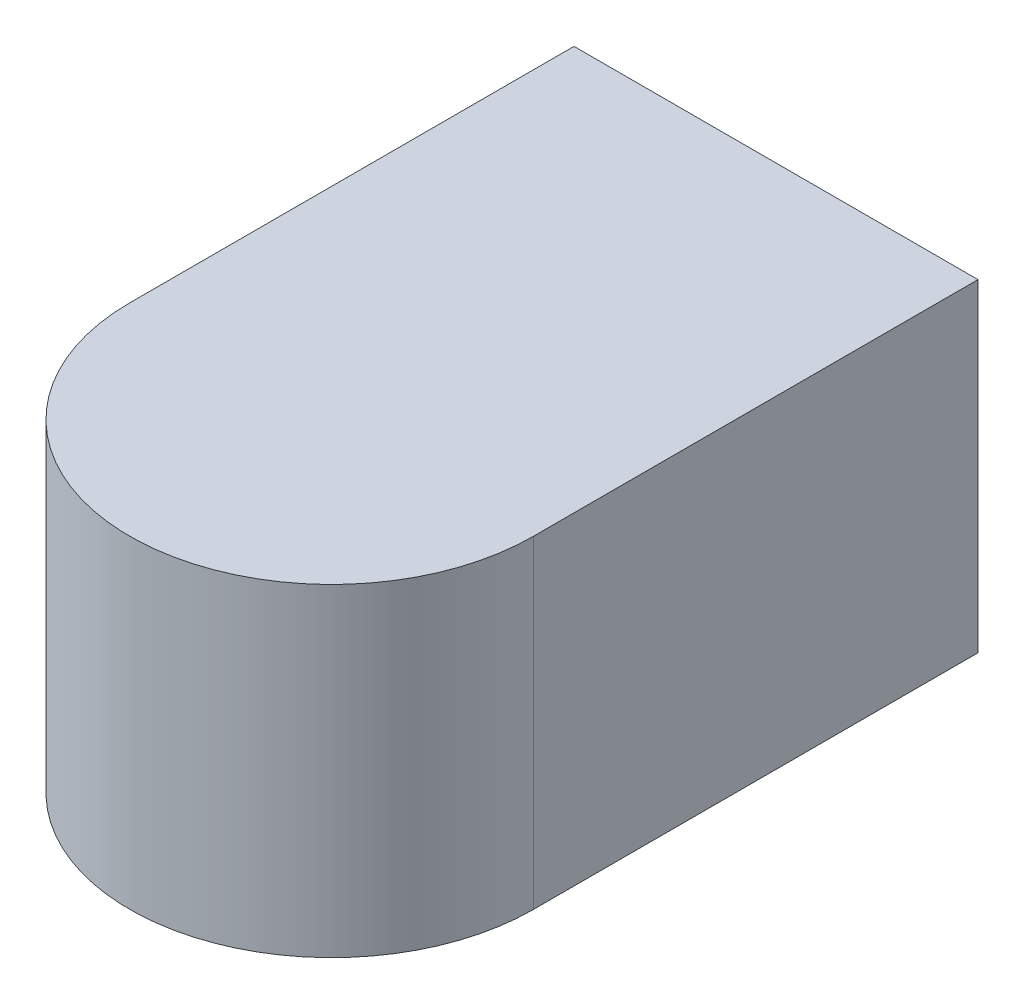
ISO-10303-21;
HEADER;
FILE_DESCRIPTION(('STEP AP214'),'2;1');
FILE_NAME('part.step','',(''),(''),'','','');
FILE_SCHEMA(('AUTOMOTIVE_DESIGN { 1 0 10303 214 1 1 1 1 }'));
ENDSEC;
DATA;
#1=APPLICATION_CONTEXT('core data for automotive mechanical design processes');
#2=APPLICATION_PROTOCOL_DEFINITION('international standard','automotive_design',2000,#1);
#3=PRODUCT_CONTEXT('',#1,'mechanical');
#4=PRODUCT('Part','Part','',(#3));
#5=PRODUCT_RELATED_PRODUCT_CATEGORY('part','',(#4));
#6=PRODUCT_DEFINITION_FORMATION('','',#4);
#7=PRODUCT_DEFINITION_CONTEXT('part definition',#1,'design');
#8=PRODUCT_DEFINITION('design','',#6,#7);
#9=PRODUCT_DEFINITION_SHAPE('','',#8);
#10=(LENGTH_UNIT() NAMED_UNIT(*) SI_UNIT(.MILLI.,.METRE.));
#11=(NAMED_UNIT(*) PLANE_ANGLE_UNIT() SI_UNIT($,.RADIAN.));
#12=(NAMED_UNIT(*) SI_UNIT($,.STERADIAN.) SOLID_ANGLE_UNIT());
#13=UNCERTAINTY_MEASURE_WITH_UNIT(LENGTH_MEASURE(1.E-05),#10,'distance_accuracy_value','');
#14=(GEOMETRIC_REPRESENTATION_CONTEXT(3) GLOBAL_UNCERTAINTY_ASSIGNED_CONTEXT((#13)) GLOBAL_UNIT_ASSIGNED_CONTEXT((#10,
#11,#12)) REPRESENTATION_CONTEXT('',''));
#15=CARTESIAN_POINT('',(0.,0.,0.));
#16=DIRECTION('',(0.,0.,1.));
#17=DIRECTION('',(1.,0.,0.));
#18=AXIS2_PLACEMENT_3D('',#15,#16,#17);
#19=CARTESIAN_POINT('',(0.,0.,0.));
#20=DIRECTION('',(0.,1.,0.));
#21=DIRECTION('',(1.,0.,0.));
#22=AXIS2_PLACEMENT_3D('',#19,#20,#21);
#23=PLANE('',#22);
#24=DIRECTION('',(-1.,0.,0.));
#25=VECTOR('',#24,1.);
#26=CARTESIAN_POINT('',(0.875,0.,-1.5));
#27=LINE('',#26,#25);
#28=CARTESIAN_POINT('',(0.875,0.,-1.5));
#29=VERTEX_POINT('',#28);
#30=CARTESIAN_POINT('',(0.625,0.,-1.5));
#31=VERTEX_POINT('',#30);
#32=EDGE_CURVE('E11',#29,#31,#27,.T.);
#33=ORIENTED_EDGE('',*,*,#32,.F.);
#34=DIRECTION('',(0.,0.,-1.));
#35=VECTOR('',#34,1.);
#36=CARTESIAN_POINT('',(0.875,0.,-1.225));
#37=LINE('',#36,#35);
#38=CARTESIAN_POINT('',(0.875,0.,-1.225));
#39=VERTEX_POINT('',#38);
#40=EDGE_CURVE('E24',#39,#29,#37,.T.);
#41=ORIENTED_EDGE('',*,*,#40,.F.);
#42=CARTESIAN_POINT('',(0.75,0.,-1.225));
#43=DIRECTION('',(0.,1.,0.));
#44=DIRECTION('',(-1.,0.,0.));
#45=AXIS2_PLACEMENT_3D('',#42,#43,#44);
#46=CIRCLE('',#45,0.125);
#47=CARTESIAN_POINT('',(0.625,0.,-1.225));
#48=VERTEX_POINT('',#47);
#49=EDGE_CURVE('E61',#48,#39,#46,.T.);
#50=ORIENTED_EDGE('',*,*,#49,.F.);
#51=DIRECTION('',(0.,0.,1.));
#52=VECTOR('',#51,1.);
#53=CARTESIAN_POINT('',(0.625,0.,-1.5));
#54=LINE('',#53,#52);
#55=EDGE_CURVE('E37',#31,#48,#54,.T.);
#56=ORIENTED_EDGE('',*,*,#55,.F.);
#57=EDGE_LOOP('',(#33,#41,#50,#56));
#58=FACE_BOUND('',#57,.T.);
#59=ADVANCED_FACE('F17',(#58),#23,.F.);
#60=CARTESIAN_POINT('',(0.625,0.,-1.5));
#61=DIRECTION('',(-1.,0.,0.));
#62=DIRECTION('',(0.,0.,1.));
#63=AXIS2_PLACEMENT_3D('',#60,#61,#62);
#64=PLANE('',#63);
#65=DIRECTION('',(0.,1.,0.));
#66=VECTOR('',#65,1.);
#67=CARTESIAN_POINT('',(0.625,0.,-1.225));
#68=LINE('',#67,#66);
#69=CARTESIAN_POINT('',(0.625,0.2,-1.225));
#70=VERTEX_POINT('',#69);
#71=EDGE_CURVE('E84',#48,#70,#68,.T.);
#72=ORIENTED_EDGE('',*,*,#71,.T.);
#73=DIRECTION('',(0.,0.,1.));
#74=VECTOR('',#73,1.);
#75=CARTESIAN_POINT('',(0.625,0.2,-1.5));
#76=LINE('',#75,#74);
#77=CARTESIAN_POINT('',(0.625,0.2,-1.5));
#78=VERTEX_POINT('',#77);
#79=EDGE_CURVE('E74',#78,#70,#76,.T.);
#80=ORIENTED_EDGE('',*,*,#79,.F.);
#81=DIRECTION('',(0.,1.,0.));
#82=VECTOR('',#81,1.);
#83=CARTESIAN_POINT('',(0.625,0.,-1.5));
#84=LINE('',#83,#82);
#85=EDGE_CURVE('E81',#31,#78,#84,.T.);
#86=ORIENTED_EDGE('',*,*,#85,.F.);
#87=ORIENTED_EDGE('',*,*,#55,.T.);
#88=EDGE_LOOP('',(#72,#80,#86,#87));
#89=FACE_BOUND('',#88,.T.);
#90=ADVANCED_FACE('F89',(#89),#64,.T.);
#91=CARTESIAN_POINT('',(0.875,0.,-1.5));
#92=DIRECTION('',(0.,0.,-1.));
#93=DIRECTION('',(-1.,0.,0.));
#94=AXIS2_PLACEMENT_3D('',#91,#92,#93);
#95=PLANE('',#94);
#96=ORIENTED_EDGE('',*,*,#85,.T.);
#97=DIRECTION('',(-1.,0.,0.));
#98=VECTOR('',#97,1.);
#99=CARTESIAN_POINT('',(0.875,0.2,-1.5));
#100=LINE('',#99,#98);
#101=CARTESIAN_POINT('',(0.875,0.2,-1.5));
#102=VERTEX_POINT('',#101);
#103=EDGE_CURVE('E79',#102,#78,#100,.T.);
#104=ORIENTED_EDGE('',*,*,#103,.F.);
#105=DIRECTION('',(0.,1.,0.));
#106=VECTOR('',#105,1.);
#107=CARTESIAN_POINT('',(0.875,0.,-1.5));
#108=LINE('',#107,#106);
#109=EDGE_CURVE('E67',#29,#102,#108,.T.);
#110=ORIENTED_EDGE('',*,*,#109,.F.);
#111=ORIENTED_EDGE('',*,*,#32,.T.);
#112=EDGE_LOOP('',(#96,#104,#110,#111));
#113=FACE_BOUND('',#112,.T.);
#114=ADVANCED_FACE('F91',(#113),#95,.T.);
#115=CARTESIAN_POINT('',(0.875,0.,-1.225));
#116=DIRECTION('',(1.,0.,0.));
#117=DIRECTION('',(0.,0.,-1.));
#118=AXIS2_PLACEMENT_3D('',#115,#116,#117);
#119=PLANE('',#118);
#120=ORIENTED_EDGE('',*,*,#109,.T.);
#121=DIRECTION('',(0.,0.,-1.));
#122=VECTOR('',#121,1.);
#123=CARTESIAN_POINT('',(0.875,0.2,-1.225));
#124=LINE('',#123,#122);
#125=CARTESIAN_POINT('',(0.875,0.2,-1.225));
#126=VERTEX_POINT('',#125);
#127=EDGE_CURVE('E62',#126,#102,#124,.T.);
#128=ORIENTED_EDGE('',*,*,#127,.F.);
#129=DIRECTION('',(0.,1.,0.));
#130=VECTOR('',#129,1.);
#131=CARTESIAN_POINT('',(0.875,0.,-1.225));
#132=LINE('',#131,#130);
#133=EDGE_CURVE('E55',#39,#126,#132,.T.);
#134=ORIENTED_EDGE('',*,*,#133,.F.);
#135=ORIENTED_EDGE('',*,*,#40,.T.);
#136=EDGE_LOOP('',(#120,#128,#134,#135));
#137=FACE_BOUND('',#136,.T.);
#138=ADVANCED_FACE('F65',(#137),#119,.T.);
#139=CARTESIAN_POINT('',(0.75,0.,-1.225));
#140=DIRECTION('',(0.,1.,0.));
#141=DIRECTION('',(1.,0.,0.));
#142=AXIS2_PLACEMENT_3D('',#139,#140,#141);
#143=CYLINDRICAL_SURFACE('',#142,0.125);
#144=ORIENTED_EDGE('',*,*,#133,.T.);
#145=CARTESIAN_POINT('',(0.75,0.2,-1.225));
#146=DIRECTION('',(0.,1.,0.));
#147=DIRECTION('',(-1.,0.,0.));
#148=AXIS2_PLACEMENT_3D('',#145,#146,#147);
#149=CIRCLE('',#148,0.125);
#150=EDGE_CURVE('E60',#70,#126,#149,.T.);
#151=ORIENTED_EDGE('',*,*,#150,.F.);
#152=ORIENTED_EDGE('',*,*,#71,.F.);
#153=ORIENTED_EDGE('',*,*,#49,.T.);
#154=EDGE_LOOP('',(#144,#151,#152,#153));
#155=FACE_BOUND('',#154,.T.);
#156=ADVANCED_FACE('F57',(#155),#143,.T.);
#157=CARTESIAN_POINT('',(0.,0.2,0.));
#158=DIRECTION('',(0.,1.,0.));
#159=DIRECTION('',(1.,0.,0.));
#160=AXIS2_PLACEMENT_3D('',#157,#158,#159);
#161=PLANE('',#160);
#162=ORIENTED_EDGE('',*,*,#150,.T.);
#163=ORIENTED_EDGE('',*,*,#127,.T.);
#164=ORIENTED_EDGE('',*,*,#103,.T.);
#165=ORIENTED_EDGE('',*,*,#79,.T.);
#166=EDGE_LOOP('',(#162,#163,#164,#165));
#167=FACE_BOUND('',#166,.T.);
#168=ADVANCED_FACE('F72',(#167),#161,.T.);
#169=CLOSED_SHELL('',(#59,#90,#114,#138,#156,#168));
#170=MANIFOLD_SOLID_BREP('B1',#169);
#171=ADVANCED_BREP_SHAPE_REPRESENTATION('',(#18,#170),#14);
#172=SHAPE_DEFINITION_REPRESENTATION(#9,#171);
ENDSEC;
END-ISO-10303-21;
